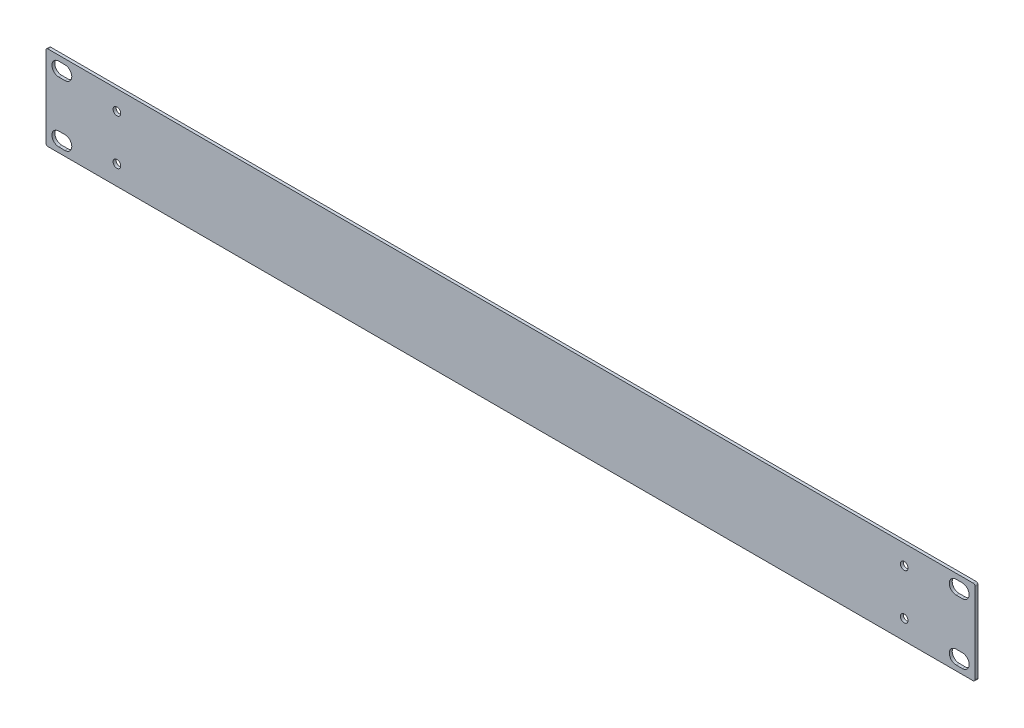
ISO-10303-21;
HEADER;
FILE_DESCRIPTION(('STEP AP214'),'2;1');
FILE_NAME('part.step','',(''),(''),'','','');
FILE_SCHEMA(('AUTOMOTIVE_DESIGN { 1 0 10303 214 1 1 1 1 }'));
ENDSEC;
DATA;
#1=APPLICATION_CONTEXT('core data for automotive mechanical design processes');
#2=APPLICATION_PROTOCOL_DEFINITION('international standard','automotive_design',2000,#1);
#3=PRODUCT_CONTEXT('',#1,'mechanical');
#4=PRODUCT('Part','Part','',(#3));
#5=PRODUCT_RELATED_PRODUCT_CATEGORY('part','',(#4));
#6=PRODUCT_DEFINITION_FORMATION('','',#4);
#7=PRODUCT_DEFINITION_CONTEXT('part definition',#1,'design');
#8=PRODUCT_DEFINITION('design','',#6,#7);
#9=PRODUCT_DEFINITION_SHAPE('','',#8);
#10=(LENGTH_UNIT() NAMED_UNIT(*) SI_UNIT(.MILLI.,.METRE.));
#11=(NAMED_UNIT(*) PLANE_ANGLE_UNIT() SI_UNIT($,.RADIAN.));
#12=(NAMED_UNIT(*) SI_UNIT($,.STERADIAN.) SOLID_ANGLE_UNIT());
#13=UNCERTAINTY_MEASURE_WITH_UNIT(LENGTH_MEASURE(1.E-05),#10,'distance_accuracy_value','');
#14=(GEOMETRIC_REPRESENTATION_CONTEXT(3) GLOBAL_UNCERTAINTY_ASSIGNED_CONTEXT((#13)) GLOBAL_UNIT_ASSIGNED_CONTEXT((#10,
#11,#12)) REPRESENTATION_CONTEXT('',''));
#15=CARTESIAN_POINT('',(0.,0.,0.));
#16=DIRECTION('',(0.,0.,1.));
#17=DIRECTION('',(1.,0.,0.));
#18=AXIS2_PLACEMENT_3D('',#15,#16,#17);
#19=CARTESIAN_POINT('',(-240.284,1.01599999999993,-1.524));
#20=DIRECTION('',(0.,0.,1.));
#21=DIRECTION('',(1.,0.,0.));
#22=AXIS2_PLACEMENT_3D('',#19,#20,#21);
#23=CYLINDRICAL_SURFACE('',#22,1.01599999999998);
#24=CARTESIAN_POINT('',(-240.284,1.01599999999993,0.));
#25=DIRECTION('',(0.,0.,1.));
#26=DIRECTION('',(-1.,0.,0.));
#27=AXIS2_PLACEMENT_3D('',#24,#25,#26);
#28=CIRCLE('',#27,1.01599999999998);
#29=CARTESIAN_POINT('',(-241.3,1.01599999999993,0.));
#30=VERTEX_POINT('',#29);
#31=CARTESIAN_POINT('',(-240.284,0.,0.));
#32=VERTEX_POINT('',#31);
#33=EDGE_CURVE('E331',#30,#32,#28,.T.);
#34=ORIENTED_EDGE('',*,*,#33,.F.);
#35=DIRECTION('',(0.,0.,1.));
#36=VECTOR('',#35,1.);
#37=CARTESIAN_POINT('',(-241.3,1.01599999999993,-1.524));
#38=LINE('',#37,#36);
#39=CARTESIAN_POINT('',(-241.3,1.01599999999993,-1.524));
#40=VERTEX_POINT('',#39);
#41=EDGE_CURVE('E11',#40,#30,#38,.T.);
#42=ORIENTED_EDGE('',*,*,#41,.F.);
#43=CARTESIAN_POINT('',(-240.284,1.01599999999993,-1.524));
#44=DIRECTION('',(0.,0.,1.));
#45=DIRECTION('',(-1.,0.,0.));
#46=AXIS2_PLACEMENT_3D('',#43,#44,#45);
#47=CIRCLE('',#46,1.01599999999998);
#48=CARTESIAN_POINT('',(-240.284,0.,-1.524));
#49=VERTEX_POINT('',#48);
#50=EDGE_CURVE('E338',#40,#49,#47,.T.);
#51=ORIENTED_EDGE('',*,*,#50,.T.);
#52=DIRECTION('',(0.,0.,1.));
#53=VECTOR('',#52,1.);
#54=CARTESIAN_POINT('',(-240.284,0.,-1.524));
#55=LINE('',#54,#53);
#56=EDGE_CURVE('E41',#49,#32,#55,.T.);
#57=ORIENTED_EDGE('',*,*,#56,.T.);
#58=EDGE_LOOP('',(#34,#42,#51,#57));
#59=FACE_BOUND('',#58,.T.);
#60=ADVANCED_FACE('F38',(#59),#23,.T.);
#61=CARTESIAN_POINT('',(-241.3,42.9259999999999,-1.524));
#62=DIRECTION('',(-1.,0.,0.));
#63=DIRECTION('',(0.,0.,1.));
#64=AXIS2_PLACEMENT_3D('',#61,#62,#63);
#65=PLANE('',#64);
#66=DIRECTION('',(0.,-1.,0.));
#67=VECTOR('',#66,1.);
#68=CARTESIAN_POINT('',(-241.3,42.9259999999999,0.));
#69=LINE('',#68,#67);
#70=CARTESIAN_POINT('',(-241.3,42.9259999999999,0.));
#71=VERTEX_POINT('',#70);
#72=EDGE_CURVE('E342',#71,#30,#69,.T.);
#73=ORIENTED_EDGE('',*,*,#72,.F.);
#74=DIRECTION('',(0.,0.,1.));
#75=VECTOR('',#74,1.);
#76=CARTESIAN_POINT('',(-241.3,42.9259999999999,-1.524));
#77=LINE('',#76,#75);
#78=CARTESIAN_POINT('',(-241.3,42.9259999999999,-1.524));
#79=VERTEX_POINT('',#78);
#80=EDGE_CURVE('E46',#79,#71,#77,.T.);
#81=ORIENTED_EDGE('',*,*,#80,.F.);
#82=DIRECTION('',(0.,-1.,0.));
#83=VECTOR('',#82,1.);
#84=CARTESIAN_POINT('',(-241.3,42.9259999999999,-1.524));
#85=LINE('',#84,#83);
#86=EDGE_CURVE('E360',#79,#40,#85,.T.);
#87=ORIENTED_EDGE('',*,*,#86,.T.);
#88=ORIENTED_EDGE('',*,*,#41,.T.);
#89=EDGE_LOOP('',(#73,#81,#87,#88));
#90=FACE_BOUND('',#89,.T.);
#91=ADVANCED_FACE('F407',(#90),#65,.T.);
#92=CARTESIAN_POINT('',(-240.284,42.9259999999999,-1.524));
#93=DIRECTION('',(0.,0.,1.));
#94=DIRECTION('',(1.,0.,0.));
#95=AXIS2_PLACEMENT_3D('',#92,#93,#94);
#96=CYLINDRICAL_SURFACE('',#95,1.01599999999999);
#97=CARTESIAN_POINT('',(-240.284,42.9259999999999,0.));
#98=DIRECTION('',(0.,0.,1.));
#99=DIRECTION('',(1.,0.,0.));
#100=AXIS2_PLACEMENT_3D('',#97,#98,#99);
#101=CIRCLE('',#100,1.01599999999999);
#102=CARTESIAN_POINT('',(-240.284,43.9419999999999,0.));
#103=VERTEX_POINT('',#102);
#104=EDGE_CURVE('E380',#103,#71,#101,.T.);
#105=ORIENTED_EDGE('',*,*,#104,.F.);
#106=DIRECTION('',(0.,0.,1.));
#107=VECTOR('',#106,1.);
#108=CARTESIAN_POINT('',(-240.284,43.9419999999999,-1.524));
#109=LINE('',#108,#107);
#110=CARTESIAN_POINT('',(-240.284,43.9419999999999,-1.524));
#111=VERTEX_POINT('',#110);
#112=EDGE_CURVE('E386',#111,#103,#109,.T.);
#113=ORIENTED_EDGE('',*,*,#112,.F.);
#114=CARTESIAN_POINT('',(-240.284,42.9259999999999,-1.524));
#115=DIRECTION('',(0.,0.,1.));
#116=DIRECTION('',(1.,0.,0.));
#117=AXIS2_PLACEMENT_3D('',#114,#115,#116);
#118=CIRCLE('',#117,1.01599999999999);
#119=EDGE_CURVE('E357',#111,#79,#118,.T.);
#120=ORIENTED_EDGE('',*,*,#119,.T.);
#121=ORIENTED_EDGE('',*,*,#80,.T.);
#122=EDGE_LOOP('',(#105,#113,#120,#121));
#123=FACE_BOUND('',#122,.T.);
#124=ADVANCED_FACE('F427',(#123),#96,.T.);
#125=CARTESIAN_POINT('',(240.284,43.942,-1.524));
#126=DIRECTION('',(0.,1.,0.));
#127=DIRECTION('',(-1.,0.,0.));
#128=AXIS2_PLACEMENT_3D('',#125,#126,#127);
#129=PLANE('',#128);
#130=DIRECTION('',(-1.,0.,0.));
#131=VECTOR('',#130,1.);
#132=CARTESIAN_POINT('',(240.284,43.942,0.));
#133=LINE('',#132,#131);
#134=CARTESIAN_POINT('',(240.284,43.9419999999999,0.));
#135=VERTEX_POINT('',#134);
#136=EDGE_CURVE('E377',#135,#103,#133,.T.);
#137=ORIENTED_EDGE('',*,*,#136,.F.);
#138=DIRECTION('',(0.,0.,1.));
#139=VECTOR('',#138,1.);
#140=CARTESIAN_POINT('',(240.284,43.9419999999999,-1.524));
#141=LINE('',#140,#139);
#142=CARTESIAN_POINT('',(240.284,43.9419999999999,-1.524));
#143=VERTEX_POINT('',#142);
#144=EDGE_CURVE('E388',#143,#135,#141,.T.);
#145=ORIENTED_EDGE('',*,*,#144,.F.);
#146=DIRECTION('',(-1.,0.,0.));
#147=VECTOR('',#146,1.);
#148=CARTESIAN_POINT('',(240.284,43.942,-1.524));
#149=LINE('',#148,#147);
#150=EDGE_CURVE('E354',#143,#111,#149,.T.);
#151=ORIENTED_EDGE('',*,*,#150,.T.);
#152=ORIENTED_EDGE('',*,*,#112,.T.);
#153=EDGE_LOOP('',(#137,#145,#151,#152));
#154=FACE_BOUND('',#153,.T.);
#155=ADVANCED_FACE('F425',(#154),#129,.T.);
#156=CARTESIAN_POINT('',(240.284,42.9259999999999,-1.524));
#157=DIRECTION('',(0.,0.,1.));
#158=DIRECTION('',(1.,0.,0.));
#159=AXIS2_PLACEMENT_3D('',#156,#157,#158);
#160=CYLINDRICAL_SURFACE('',#159,1.01599999999999);
#161=CARTESIAN_POINT('',(240.284,42.9259999999999,0.));
#162=DIRECTION('',(0.,0.,1.));
#163=DIRECTION('',(-1.,0.,0.));
#164=AXIS2_PLACEMENT_3D('',#161,#162,#163);
#165=CIRCLE('',#164,1.01599999999999);
#166=CARTESIAN_POINT('',(241.3,42.926,0.));
#167=VERTEX_POINT('',#166);
#168=EDGE_CURVE('E374',#167,#135,#165,.T.);
#169=ORIENTED_EDGE('',*,*,#168,.F.);
#170=DIRECTION('',(0.,0.,1.));
#171=VECTOR('',#170,1.);
#172=CARTESIAN_POINT('',(241.3,42.926,-1.524));
#173=LINE('',#172,#171);
#174=CARTESIAN_POINT('',(241.3,42.926,-1.524));
#175=VERTEX_POINT('',#174);
#176=EDGE_CURVE('E390',#175,#167,#173,.T.);
#177=ORIENTED_EDGE('',*,*,#176,.F.);
#178=CARTESIAN_POINT('',(240.284,42.9259999999999,-1.524));
#179=DIRECTION('',(0.,0.,1.));
#180=DIRECTION('',(-1.,0.,0.));
#181=AXIS2_PLACEMENT_3D('',#178,#179,#180);
#182=CIRCLE('',#181,1.01599999999999);
#183=EDGE_CURVE('E351',#175,#143,#182,.T.);
#184=ORIENTED_EDGE('',*,*,#183,.T.);
#185=ORIENTED_EDGE('',*,*,#144,.T.);
#186=EDGE_LOOP('',(#169,#177,#184,#185));
#187=FACE_BOUND('',#186,.T.);
#188=ADVANCED_FACE('F421',(#187),#160,.T.);
#189=CARTESIAN_POINT('',(241.3,42.926,-1.524));
#190=DIRECTION('',(1.,0.,0.));
#191=DIRECTION('',(0.,0.,-1.));
#192=AXIS2_PLACEMENT_3D('',#189,#190,#191);
#193=PLANE('',#192);
#194=DIRECTION('',(0.,1.,0.));
#195=VECTOR('',#194,1.);
#196=CARTESIAN_POINT('',(241.3,42.926,0.));
#197=LINE('',#196,#195);
#198=CARTESIAN_POINT('',(241.3,1.01599999999999,0.));
#199=VERTEX_POINT('',#198);
#200=EDGE_CURVE('E371',#199,#167,#197,.T.);
#201=ORIENTED_EDGE('',*,*,#200,.F.);
#202=DIRECTION('',(0.,0.,1.));
#203=VECTOR('',#202,1.);
#204=CARTESIAN_POINT('',(241.3,1.01599999999999,-1.524));
#205=LINE('',#204,#203);
#206=CARTESIAN_POINT('',(241.3,1.01599999999999,-1.524));
#207=VERTEX_POINT('',#206);
#208=EDGE_CURVE('E392',#207,#199,#205,.T.);
#209=ORIENTED_EDGE('',*,*,#208,.F.);
#210=DIRECTION('',(0.,1.,0.));
#211=VECTOR('',#210,1.);
#212=CARTESIAN_POINT('',(241.3,42.926,-1.524));
#213=LINE('',#212,#211);
#214=EDGE_CURVE('E348',#207,#175,#213,.T.);
#215=ORIENTED_EDGE('',*,*,#214,.T.);
#216=ORIENTED_EDGE('',*,*,#176,.T.);
#217=EDGE_LOOP('',(#201,#209,#215,#216));
#218=FACE_BOUND('',#217,.T.);
#219=ADVANCED_FACE('F419',(#218),#193,.T.);
#220=CARTESIAN_POINT('',(240.284,1.01599999999999,-1.524));
#221=DIRECTION('',(0.,0.,1.));
#222=DIRECTION('',(1.,0.,0.));
#223=AXIS2_PLACEMENT_3D('',#220,#221,#222);
#224=CYLINDRICAL_SURFACE('',#223,1.01599999999998);
#225=CARTESIAN_POINT('',(240.284,1.01599999999999,0.));
#226=DIRECTION('',(0.,0.,1.));
#227=DIRECTION('',(-1.,0.,0.));
#228=AXIS2_PLACEMENT_3D('',#225,#226,#227);
#229=CIRCLE('',#228,1.01599999999998);
#230=CARTESIAN_POINT('',(240.284,0.,0.));
#231=VERTEX_POINT('',#230);
#232=EDGE_CURVE('E368',#231,#199,#229,.T.);
#233=ORIENTED_EDGE('',*,*,#232,.F.);
#234=DIRECTION('',(0.,0.,1.));
#235=VECTOR('',#234,1.);
#236=CARTESIAN_POINT('',(240.284,0.,-1.524));
#237=LINE('',#236,#235);
#238=CARTESIAN_POINT('',(240.284,0.,-1.524));
#239=VERTEX_POINT('',#238);
#240=EDGE_CURVE('E393',#239,#231,#237,.T.);
#241=ORIENTED_EDGE('',*,*,#240,.F.);
#242=CARTESIAN_POINT('',(240.284,1.01599999999999,-1.524));
#243=DIRECTION('',(0.,0.,1.));
#244=DIRECTION('',(-1.,0.,0.));
#245=AXIS2_PLACEMENT_3D('',#242,#243,#244);
#246=CIRCLE('',#245,1.01599999999998);
#247=EDGE_CURVE('E345',#239,#207,#246,.T.);
#248=ORIENTED_EDGE('',*,*,#247,.T.);
#249=ORIENTED_EDGE('',*,*,#208,.T.);
#250=EDGE_LOOP('',(#233,#241,#248,#249));
#251=FACE_BOUND('',#250,.T.);
#252=ADVANCED_FACE('F415',(#251),#224,.T.);
#253=CARTESIAN_POINT('',(240.284,0.,-1.524));
#254=DIRECTION('',(0.,-1.,0.));
#255=DIRECTION('',(1.,0.,0.));
#256=AXIS2_PLACEMENT_3D('',#253,#254,#255);
#257=PLANE('',#256);
#258=DIRECTION('',(1.,0.,0.));
#259=VECTOR('',#258,1.);
#260=CARTESIAN_POINT('',(240.284,0.,0.));
#261=LINE('',#260,#259);
#262=EDGE_CURVE('E365',#32,#231,#261,.T.);
#263=ORIENTED_EDGE('',*,*,#262,.F.);
#264=ORIENTED_EDGE('',*,*,#56,.F.);
#265=DIRECTION('',(1.,0.,0.));
#266=VECTOR('',#265,1.);
#267=CARTESIAN_POINT('',(240.284,0.,-1.524));
#268=LINE('',#267,#266);
#269=EDGE_CURVE('E341',#49,#239,#268,.T.);
#270=ORIENTED_EDGE('',*,*,#269,.T.);
#271=ORIENTED_EDGE('',*,*,#240,.T.);
#272=EDGE_LOOP('',(#263,#264,#270,#271));
#273=FACE_BOUND('',#272,.T.);
#274=ADVANCED_FACE('F401',(#273),#257,.T.);
#275=CARTESIAN_POINT('',(-240.284,1.01599999999993,-1.524));
#276=DIRECTION('',(0.,0.,-1.));
#277=DIRECTION('',(-1.,0.,0.));
#278=AXIS2_PLACEMENT_3D('',#275,#276,#277);
#279=PLANE('',#278);
#280=CARTESIAN_POINT('',(-204.47,10.1599999999999,-1.524));
#281=DIRECTION('',(0.,0.,1.));
#282=DIRECTION('',(-1.,0.,0.));
#283=AXIS2_PLACEMENT_3D('',#280,#281,#282);
#284=CIRCLE('',#283,2.);
#285=CARTESIAN_POINT('',(-206.47,10.1599999999999,-1.524));
#286=VERTEX_POINT('',#285);
#287=EDGE_CURVE('E765',#286,#286,#284,.T.);
#288=ORIENTED_EDGE('',*,*,#287,.T.);
#289=EDGE_LOOP('',(#288));
#290=FACE_BOUND('',#289,.T.);
#291=CARTESIAN_POINT('',(204.47,10.1599999999994,-1.524));
#292=DIRECTION('',(0.,0.,1.));
#293=DIRECTION('',(1.,0.,0.));
#294=AXIS2_PLACEMENT_3D('',#291,#292,#293);
#295=CIRCLE('',#294,2.);
#296=CARTESIAN_POINT('',(206.47,10.1599999999994,-1.524));
#297=VERTEX_POINT('',#296);
#298=EDGE_CURVE('E769',#297,#297,#295,.T.);
#299=ORIENTED_EDGE('',*,*,#298,.T.);
#300=EDGE_LOOP('',(#299));
#301=FACE_BOUND('',#300,.T.);
#302=CARTESIAN_POINT('',(204.47,33.7819999999994,-1.524));
#303=DIRECTION('',(0.,0.,1.));
#304=DIRECTION('',(-1.,0.,0.));
#305=AXIS2_PLACEMENT_3D('',#302,#303,#304);
#306=CIRCLE('',#305,2.);
#307=CARTESIAN_POINT('',(202.47,33.7819999999994,-1.524));
#308=VERTEX_POINT('',#307);
#309=EDGE_CURVE('E778',#308,#308,#306,.T.);
#310=ORIENTED_EDGE('',*,*,#309,.T.);
#311=EDGE_LOOP('',(#310));
#312=FACE_BOUND('',#311,.T.);
#313=CARTESIAN_POINT('',(-204.47,33.7819999999999,-1.524));
#314=DIRECTION('',(0.,0.,1.));
#315=DIRECTION('',(1.,0.,0.));
#316=AXIS2_PLACEMENT_3D('',#313,#314,#315);
#317=CIRCLE('',#316,2.);
#318=CARTESIAN_POINT('',(-202.47,33.7819999999999,-1.524));
#319=VERTEX_POINT('',#318);
#320=EDGE_CURVE('E291',#319,#319,#317,.T.);
#321=ORIENTED_EDGE('',*,*,#320,.T.);
#322=EDGE_LOOP('',(#321));
#323=FACE_BOUND('',#322,.T.);
#324=CARTESIAN_POINT('',(-234.6706,37.6935999999998,-1.524));
#325=DIRECTION('',(0.,0.,1.));
#326=DIRECTION('',(-1.,0.,0.));
#327=AXIS2_PLACEMENT_3D('',#324,#325,#326);
#328=CIRCLE('',#327,3.556);
#329=CARTESIAN_POINT('',(-234.6706,41.2495999999998,-1.524));
#330=VERTEX_POINT('',#329);
#331=CARTESIAN_POINT('',(-234.6706,34.1375999999998,-1.524));
#332=VERTEX_POINT('',#331);
#333=EDGE_CURVE('E203',#330,#332,#328,.T.);
#334=ORIENTED_EDGE('',*,*,#333,.T.);
#335=DIRECTION('',(1.,0.,0.));
#336=VECTOR('',#335,1.);
#337=CARTESIAN_POINT('',(-234.6706,34.1375999999998,-1.524));
#338=LINE('',#337,#336);
#339=CARTESIAN_POINT('',(-231.4702,34.1375999999998,-1.524));
#340=VERTEX_POINT('',#339);
#341=EDGE_CURVE('E214',#332,#340,#338,.T.);
#342=ORIENTED_EDGE('',*,*,#341,.T.);
#343=CARTESIAN_POINT('',(-231.4702,37.6935999999998,-1.524));
#344=DIRECTION('',(0.,0.,1.));
#345=DIRECTION('',(-1.,0.,0.));
#346=AXIS2_PLACEMENT_3D('',#343,#344,#345);
#347=CIRCLE('',#346,3.556);
#348=CARTESIAN_POINT('',(-231.4702,41.2495999999998,-1.524));
#349=VERTEX_POINT('',#348);
#350=EDGE_CURVE('E54',#340,#349,#347,.T.);
#351=ORIENTED_EDGE('',*,*,#350,.T.);
#352=DIRECTION('',(-1.,0.,0.));
#353=VECTOR('',#352,1.);
#354=CARTESIAN_POINT('',(-234.6706,41.2495999999998,-1.524));
#355=LINE('',#354,#353);
#356=EDGE_CURVE('E211',#349,#330,#355,.T.);
#357=ORIENTED_EDGE('',*,*,#356,.T.);
#358=EDGE_LOOP('',(#334,#342,#351,#357));
#359=FACE_BOUND('',#358,.T.);
#360=CARTESIAN_POINT('',(234.6706,6.24839999999933,-1.524));
#361=DIRECTION('',(0.,0.,1.));
#362=DIRECTION('',(-1.,0.,0.));
#363=AXIS2_PLACEMENT_3D('',#360,#361,#362);
#364=CIRCLE('',#363,3.556);
#365=CARTESIAN_POINT('',(234.6706,2.69239999999933,-1.524));
#366=VERTEX_POINT('',#365);
#367=CARTESIAN_POINT('',(234.6706,9.80439999999933,-1.524));
#368=VERTEX_POINT('',#367);
#369=EDGE_CURVE('E244',#366,#368,#364,.T.);
#370=ORIENTED_EDGE('',*,*,#369,.T.);
#371=DIRECTION('',(-1.,0.,0.));
#372=VECTOR('',#371,1.);
#373=CARTESIAN_POINT('',(234.6706,9.80439999999933,-1.524));
#374=LINE('',#373,#372);
#375=CARTESIAN_POINT('',(231.4702,9.80439999999934,-1.524));
#376=VERTEX_POINT('',#375);
#377=EDGE_CURVE('E247',#368,#376,#374,.T.);
#378=ORIENTED_EDGE('',*,*,#377,.T.);
#379=CARTESIAN_POINT('',(231.4702,6.24839999999934,-1.524));
#380=DIRECTION('',(0.,0.,1.));
#381=DIRECTION('',(-1.,0.,0.));
#382=AXIS2_PLACEMENT_3D('',#379,#380,#381);
#383=CIRCLE('',#382,3.556);
#384=CARTESIAN_POINT('',(231.4702,2.69239999999934,-1.524));
#385=VERTEX_POINT('',#384);
#386=EDGE_CURVE('E62',#376,#385,#383,.T.);
#387=ORIENTED_EDGE('',*,*,#386,.T.);
#388=DIRECTION('',(1.,0.,0.));
#389=VECTOR('',#388,1.);
#390=CARTESIAN_POINT('',(234.6706,2.69239999999933,-1.524));
#391=LINE('',#390,#389);
#392=EDGE_CURVE('E252',#385,#366,#391,.T.);
#393=ORIENTED_EDGE('',*,*,#392,.T.);
#394=EDGE_LOOP('',(#370,#378,#387,#393));
#395=FACE_BOUND('',#394,.T.);
#396=CARTESIAN_POINT('',(234.6706,37.6935999999992,-1.524));
#397=DIRECTION('',(0.,0.,1.));
#398=DIRECTION('',(1.,0.,0.));
#399=AXIS2_PLACEMENT_3D('',#396,#397,#398);
#400=CIRCLE('',#399,3.556);
#401=CARTESIAN_POINT('',(234.6706,34.1375999999992,-1.524));
#402=VERTEX_POINT('',#401);
#403=CARTESIAN_POINT('',(234.6706,41.2495999999992,-1.524));
#404=VERTEX_POINT('',#403);
#405=EDGE_CURVE('E274',#402,#404,#400,.T.);
#406=ORIENTED_EDGE('',*,*,#405,.T.);
#407=DIRECTION('',(-1.,0.,0.));
#408=VECTOR('',#407,1.);
#409=CARTESIAN_POINT('',(234.6706,41.2495999999992,-1.524));
#410=LINE('',#409,#408);
#411=CARTESIAN_POINT('',(231.4702,41.2495999999992,-1.524));
#412=VERTEX_POINT('',#411);
#413=EDGE_CURVE('E277',#404,#412,#410,.T.);
#414=ORIENTED_EDGE('',*,*,#413,.T.);
#415=CARTESIAN_POINT('',(231.4702,37.6935999999992,-1.524));
#416=DIRECTION('',(0.,0.,1.));
#417=DIRECTION('',(1.,0.,0.));
#418=AXIS2_PLACEMENT_3D('',#415,#416,#417);
#419=CIRCLE('',#418,3.556);
#420=CARTESIAN_POINT('',(231.4702,34.1375999999992,-1.524));
#421=VERTEX_POINT('',#420);
#422=EDGE_CURVE('E281',#412,#421,#419,.T.);
#423=ORIENTED_EDGE('',*,*,#422,.T.);
#424=DIRECTION('',(1.,0.,0.));
#425=VECTOR('',#424,1.);
#426=CARTESIAN_POINT('',(234.6706,34.1375999999992,-1.524));
#427=LINE('',#426,#425);
#428=EDGE_CURVE('E284',#421,#402,#427,.T.);
#429=ORIENTED_EDGE('',*,*,#428,.T.);
#430=EDGE_LOOP('',(#406,#414,#423,#429));
#431=FACE_BOUND('',#430,.T.);
#432=CARTESIAN_POINT('',(-234.6706,6.24839999999992,-1.524));
#433=DIRECTION('',(0.,0.,1.));
#434=DIRECTION('',(1.,0.,0.));
#435=AXIS2_PLACEMENT_3D('',#432,#433,#434);
#436=CIRCLE('',#435,3.556);
#437=CARTESIAN_POINT('',(-234.6706,9.80439999999992,-1.524));
#438=VERTEX_POINT('',#437);
#439=CARTESIAN_POINT('',(-234.6706,2.69239999999992,-1.524));
#440=VERTEX_POINT('',#439);
#441=EDGE_CURVE('E306',#438,#440,#436,.T.);
#442=ORIENTED_EDGE('',*,*,#441,.T.);
#443=DIRECTION('',(1.,0.,0.));
#444=VECTOR('',#443,1.);
#445=CARTESIAN_POINT('',(-234.6706,2.69239999999992,-1.524));
#446=LINE('',#445,#444);
#447=CARTESIAN_POINT('',(-231.4702,2.69239999999993,-1.524));
#448=VERTEX_POINT('',#447);
#449=EDGE_CURVE('E309',#440,#448,#446,.T.);
#450=ORIENTED_EDGE('',*,*,#449,.T.);
#451=CARTESIAN_POINT('',(-231.4702,6.24839999999992,-1.524));
#452=DIRECTION('',(0.,0.,1.));
#453=DIRECTION('',(1.,0.,0.));
#454=AXIS2_PLACEMENT_3D('',#451,#452,#453);
#455=CIRCLE('',#454,3.556);
#456=CARTESIAN_POINT('',(-231.4702,9.80439999999992,-1.524));
#457=VERTEX_POINT('',#456);
#458=EDGE_CURVE('E313',#448,#457,#455,.T.);
#459=ORIENTED_EDGE('',*,*,#458,.T.);
#460=DIRECTION('',(-1.,0.,0.));
#461=VECTOR('',#460,1.);
#462=CARTESIAN_POINT('',(-234.6706,9.80439999999992,-1.524));
#463=LINE('',#462,#461);
#464=EDGE_CURVE('E316',#457,#438,#463,.T.);
#465=ORIENTED_EDGE('',*,*,#464,.T.);
#466=EDGE_LOOP('',(#442,#450,#459,#465));
#467=FACE_BOUND('',#466,.T.);
#468=ORIENTED_EDGE('',*,*,#50,.F.);
#469=ORIENTED_EDGE('',*,*,#86,.F.);
#470=ORIENTED_EDGE('',*,*,#119,.F.);
#471=ORIENTED_EDGE('',*,*,#150,.F.);
#472=ORIENTED_EDGE('',*,*,#183,.F.);
#473=ORIENTED_EDGE('',*,*,#214,.F.);
#474=ORIENTED_EDGE('',*,*,#247,.F.);
#475=ORIENTED_EDGE('',*,*,#269,.F.);
#476=EDGE_LOOP('',(#468,#469,#470,#471,#472,#473,#474,#475));
#477=FACE_BOUND('',#476,.T.);
#478=ADVANCED_FACE('F218',(#290,#301,#312,#323,#359,#395,#431,#467,#477),#279,.T.);
#479=CARTESIAN_POINT('',(-240.284,1.01599999999993,0.));
#480=DIRECTION('',(0.,0.,-1.));
#481=DIRECTION('',(-1.,0.,0.));
#482=AXIS2_PLACEMENT_3D('',#479,#480,#481);
#483=PLANE('',#482);
#484=CARTESIAN_POINT('',(-204.47,10.1599999999999,0.));
#485=DIRECTION('',(0.,0.,1.));
#486=DIRECTION('',(-1.,0.,0.));
#487=AXIS2_PLACEMENT_3D('',#484,#485,#486);
#488=CIRCLE('',#487,2.);
#489=CARTESIAN_POINT('',(-206.47,10.1599999999999,0.));
#490=VERTEX_POINT('',#489);
#491=EDGE_CURVE('E768',#490,#490,#488,.T.);
#492=ORIENTED_EDGE('',*,*,#491,.F.);
#493=EDGE_LOOP('',(#492));
#494=FACE_BOUND('',#493,.T.);
#495=CARTESIAN_POINT('',(204.47,10.1599999999994,0.));
#496=DIRECTION('',(0.,0.,1.));
#497=DIRECTION('',(1.,0.,0.));
#498=AXIS2_PLACEMENT_3D('',#495,#496,#497);
#499=CIRCLE('',#498,2.);
#500=CARTESIAN_POINT('',(206.47,10.1599999999994,0.));
#501=VERTEX_POINT('',#500);
#502=EDGE_CURVE('E773',#501,#501,#499,.T.);
#503=ORIENTED_EDGE('',*,*,#502,.F.);
#504=EDGE_LOOP('',(#503));
#505=FACE_BOUND('',#504,.T.);
#506=CARTESIAN_POINT('',(204.47,33.7819999999994,0.));
#507=DIRECTION('',(0.,0.,1.));
#508=DIRECTION('',(-1.,0.,0.));
#509=AXIS2_PLACEMENT_3D('',#506,#507,#508);
#510=CIRCLE('',#509,2.);
#511=CARTESIAN_POINT('',(202.47,33.7819999999994,0.));
#512=VERTEX_POINT('',#511);
#513=EDGE_CURVE('E781',#512,#512,#510,.T.);
#514=ORIENTED_EDGE('',*,*,#513,.F.);
#515=EDGE_LOOP('',(#514));
#516=FACE_BOUND('',#515,.T.);
#517=CARTESIAN_POINT('',(-204.47,33.7819999999999,0.));
#518=DIRECTION('',(0.,0.,1.));
#519=DIRECTION('',(1.,0.,0.));
#520=AXIS2_PLACEMENT_3D('',#517,#518,#519);
#521=CIRCLE('',#520,2.);
#522=CARTESIAN_POINT('',(-202.47,33.7819999999999,0.));
#523=VERTEX_POINT('',#522);
#524=EDGE_CURVE('E227',#523,#523,#521,.T.);
#525=ORIENTED_EDGE('',*,*,#524,.F.);
#526=EDGE_LOOP('',(#525));
#527=FACE_BOUND('',#526,.T.);
#528=DIRECTION('',(1.,0.,0.));
#529=VECTOR('',#528,1.);
#530=CARTESIAN_POINT('',(-234.6706,34.1375999999998,0.));
#531=LINE('',#530,#529);
#532=CARTESIAN_POINT('',(-234.6706,34.1375999999998,0.));
#533=VERTEX_POINT('',#532);
#534=CARTESIAN_POINT('',(-231.4702,34.1375999999998,0.));
#535=VERTEX_POINT('',#534);
#536=EDGE_CURVE('E233',#533,#535,#531,.T.);
#537=ORIENTED_EDGE('',*,*,#536,.F.);
#538=CARTESIAN_POINT('',(-234.6706,37.6935999999998,0.));
#539=DIRECTION('',(0.,0.,1.));
#540=DIRECTION('',(-1.,0.,0.));
#541=AXIS2_PLACEMENT_3D('',#538,#539,#540);
#542=CIRCLE('',#541,3.556);
#543=CARTESIAN_POINT('',(-234.6706,41.2495999999998,0.));
#544=VERTEX_POINT('',#543);
#545=EDGE_CURVE('E206',#544,#533,#542,.T.);
#546=ORIENTED_EDGE('',*,*,#545,.F.);
#547=DIRECTION('',(-1.,0.,0.));
#548=VECTOR('',#547,1.);
#549=CARTESIAN_POINT('',(-234.6706,41.2495999999998,0.));
#550=LINE('',#549,#548);
#551=CARTESIAN_POINT('',(-231.4702,41.2495999999998,0.));
#552=VERTEX_POINT('',#551);
#553=EDGE_CURVE('E221',#552,#544,#550,.T.);
#554=ORIENTED_EDGE('',*,*,#553,.F.);
#555=CARTESIAN_POINT('',(-231.4702,37.6935999999998,0.));
#556=DIRECTION('',(0.,0.,1.));
#557=DIRECTION('',(-1.,0.,0.));
#558=AXIS2_PLACEMENT_3D('',#555,#556,#557);
#559=CIRCLE('',#558,3.556);
#560=EDGE_CURVE('E224',#535,#552,#559,.T.);
#561=ORIENTED_EDGE('',*,*,#560,.F.);
#562=EDGE_LOOP('',(#537,#546,#554,#561));
#563=FACE_BOUND('',#562,.T.);
#564=DIRECTION('',(-1.,0.,0.));
#565=VECTOR('',#564,1.);
#566=CARTESIAN_POINT('',(234.6706,9.80439999999933,0.));
#567=LINE('',#566,#565);
#568=CARTESIAN_POINT('',(234.6706,9.80439999999933,0.));
#569=VERTEX_POINT('',#568);
#570=CARTESIAN_POINT('',(231.4702,9.80439999999934,0.));
#571=VERTEX_POINT('',#570);
#572=EDGE_CURVE('E258',#569,#571,#567,.T.);
#573=ORIENTED_EDGE('',*,*,#572,.F.);
#574=CARTESIAN_POINT('',(234.6706,6.24839999999933,0.));
#575=DIRECTION('',(0.,0.,1.));
#576=DIRECTION('',(-1.,0.,0.));
#577=AXIS2_PLACEMENT_3D('',#574,#575,#576);
#578=CIRCLE('',#577,3.556);
#579=CARTESIAN_POINT('',(234.6706,2.69239999999933,0.));
#580=VERTEX_POINT('',#579);
#581=EDGE_CURVE('E256',#580,#569,#578,.T.);
#582=ORIENTED_EDGE('',*,*,#581,.F.);
#583=DIRECTION('',(1.,0.,0.));
#584=VECTOR('',#583,1.);
#585=CARTESIAN_POINT('',(234.6706,2.69239999999933,0.));
#586=LINE('',#585,#584);
#587=CARTESIAN_POINT('',(231.4702,2.69239999999934,0.));
#588=VERTEX_POINT('',#587);
#589=EDGE_CURVE('E248',#588,#580,#586,.T.);
#590=ORIENTED_EDGE('',*,*,#589,.F.);
#591=CARTESIAN_POINT('',(231.4702,6.24839999999934,0.));
#592=DIRECTION('',(0.,0.,1.));
#593=DIRECTION('',(-1.,0.,0.));
#594=AXIS2_PLACEMENT_3D('',#591,#592,#593);
#595=CIRCLE('',#594,3.556);
#596=EDGE_CURVE('E262',#571,#588,#595,.T.);
#597=ORIENTED_EDGE('',*,*,#596,.F.);
#598=EDGE_LOOP('',(#573,#582,#590,#597));
#599=FACE_BOUND('',#598,.T.);
#600=DIRECTION('',(-1.,0.,0.));
#601=VECTOR('',#600,1.);
#602=CARTESIAN_POINT('',(234.6706,41.2495999999992,0.));
#603=LINE('',#602,#601);
#604=CARTESIAN_POINT('',(234.6706,41.2495999999992,0.));
#605=VERTEX_POINT('',#604);
#606=CARTESIAN_POINT('',(231.4702,41.2495999999992,0.));
#607=VERTEX_POINT('',#606);
#608=EDGE_CURVE('E290',#605,#607,#603,.T.);
#609=ORIENTED_EDGE('',*,*,#608,.F.);
#610=CARTESIAN_POINT('',(234.6706,37.6935999999992,0.));
#611=DIRECTION('',(0.,0.,1.));
#612=DIRECTION('',(1.,0.,0.));
#613=AXIS2_PLACEMENT_3D('',#610,#611,#612);
#614=CIRCLE('',#613,3.556);
#615=CARTESIAN_POINT('',(234.6706,34.1375999999992,0.));
#616=VERTEX_POINT('',#615);
#617=EDGE_CURVE('E288',#616,#605,#614,.T.);
#618=ORIENTED_EDGE('',*,*,#617,.F.);
#619=DIRECTION('',(1.,0.,0.));
#620=VECTOR('',#619,1.);
#621=CARTESIAN_POINT('',(234.6706,34.1375999999992,0.));
#622=LINE('',#621,#620);
#623=CARTESIAN_POINT('',(231.4702,34.1375999999992,0.));
#624=VERTEX_POINT('',#623);
#625=EDGE_CURVE('E278',#624,#616,#622,.T.);
#626=ORIENTED_EDGE('',*,*,#625,.F.);
#627=CARTESIAN_POINT('',(231.4702,37.6935999999992,0.));
#628=DIRECTION('',(0.,0.,1.));
#629=DIRECTION('',(1.,0.,0.));
#630=AXIS2_PLACEMENT_3D('',#627,#628,#629);
#631=CIRCLE('',#630,3.556);
#632=EDGE_CURVE('E294',#607,#624,#631,.T.);
#633=ORIENTED_EDGE('',*,*,#632,.F.);
#634=EDGE_LOOP('',(#609,#618,#626,#633));
#635=FACE_BOUND('',#634,.T.);
#636=DIRECTION('',(1.,0.,0.));
#637=VECTOR('',#636,1.);
#638=CARTESIAN_POINT('',(-234.6706,2.69239999999992,0.));
#639=LINE('',#638,#637);
#640=CARTESIAN_POINT('',(-234.6706,2.69239999999992,0.));
#641=VERTEX_POINT('',#640);
#642=CARTESIAN_POINT('',(-231.4702,2.69239999999992,0.));
#643=VERTEX_POINT('',#642);
#644=EDGE_CURVE('E321',#641,#643,#639,.T.);
#645=ORIENTED_EDGE('',*,*,#644,.F.);
#646=CARTESIAN_POINT('',(-234.6706,6.24839999999992,0.));
#647=DIRECTION('',(0.,0.,1.));
#648=DIRECTION('',(1.,0.,0.));
#649=AXIS2_PLACEMENT_3D('',#646,#647,#648);
#650=CIRCLE('',#649,3.556);
#651=CARTESIAN_POINT('',(-234.6706,9.80439999999992,0.));
#652=VERTEX_POINT('',#651);
#653=EDGE_CURVE('E240',#652,#641,#650,.T.);
#654=ORIENTED_EDGE('',*,*,#653,.F.);
#655=DIRECTION('',(-1.,0.,0.));
#656=VECTOR('',#655,1.);
#657=CARTESIAN_POINT('',(-234.6706,9.80439999999992,0.));
#658=LINE('',#657,#656);
#659=CARTESIAN_POINT('',(-231.4702,9.80439999999992,0.));
#660=VERTEX_POINT('',#659);
#661=EDGE_CURVE('E310',#660,#652,#658,.T.);
#662=ORIENTED_EDGE('',*,*,#661,.F.);
#663=CARTESIAN_POINT('',(-231.4702,6.24839999999992,0.));
#664=DIRECTION('',(0.,0.,1.));
#665=DIRECTION('',(1.,0.,0.));
#666=AXIS2_PLACEMENT_3D('',#663,#664,#665);
#667=CIRCLE('',#666,3.556);
#668=EDGE_CURVE('E324',#643,#660,#667,.T.);
#669=ORIENTED_EDGE('',*,*,#668,.F.);
#670=EDGE_LOOP('',(#645,#654,#662,#669));
#671=FACE_BOUND('',#670,.T.);
#672=ORIENTED_EDGE('',*,*,#33,.T.);
#673=ORIENTED_EDGE('',*,*,#262,.T.);
#674=ORIENTED_EDGE('',*,*,#232,.T.);
#675=ORIENTED_EDGE('',*,*,#200,.T.);
#676=ORIENTED_EDGE('',*,*,#168,.T.);
#677=ORIENTED_EDGE('',*,*,#136,.T.);
#678=ORIENTED_EDGE('',*,*,#104,.T.);
#679=ORIENTED_EDGE('',*,*,#72,.T.);
#680=EDGE_LOOP('',(#672,#673,#674,#675,#676,#677,#678,#679));
#681=FACE_BOUND('',#680,.T.);
#682=ADVANCED_FACE('F403',(#494,#505,#516,#527,#563,#599,#635,#671,#681),#483,.F.);
#683=CARTESIAN_POINT('',(-234.6706,6.24839999999992,-1.524));
#684=DIRECTION('',(0.,0.,1.));
#685=DIRECTION('',(1.,0.,0.));
#686=AXIS2_PLACEMENT_3D('',#683,#684,#685);
#687=CYLINDRICAL_SURFACE('',#686,3.556);
#688=ORIENTED_EDGE('',*,*,#653,.T.);
#689=DIRECTION('',(0.,0.,1.));
#690=VECTOR('',#689,1.);
#691=CARTESIAN_POINT('',(-234.6706,2.69239999999992,-1.524));
#692=LINE('',#691,#690);
#693=EDGE_CURVE('E319',#440,#641,#692,.T.);
#694=ORIENTED_EDGE('',*,*,#693,.F.);
#695=ORIENTED_EDGE('',*,*,#441,.F.);
#696=DIRECTION('',(0.,0.,1.));
#697=VECTOR('',#696,1.);
#698=CARTESIAN_POINT('',(-234.6706,9.80439999999992,-1.524));
#699=LINE('',#698,#697);
#700=EDGE_CURVE('E329',#438,#652,#699,.T.);
#701=ORIENTED_EDGE('',*,*,#700,.T.);
#702=EDGE_LOOP('',(#688,#694,#695,#701));
#703=FACE_BOUND('',#702,.T.);
#704=ADVANCED_FACE('F498',(#703),#687,.F.);
#705=CARTESIAN_POINT('',(-234.6706,9.80439999999992,-1.524));
#706=DIRECTION('',(0.,1.,0.));
#707=DIRECTION('',(0.,0.,1.));
#708=AXIS2_PLACEMENT_3D('',#705,#706,#707);
#709=PLANE('',#708);
#710=ORIENTED_EDGE('',*,*,#661,.T.);
#711=ORIENTED_EDGE('',*,*,#700,.F.);
#712=ORIENTED_EDGE('',*,*,#464,.F.);
#713=DIRECTION('',(0.,0.,1.));
#714=VECTOR('',#713,1.);
#715=CARTESIAN_POINT('',(-231.4702,9.80439999999992,-1.524));
#716=LINE('',#715,#714);
#717=EDGE_CURVE('E332',#457,#660,#716,.T.);
#718=ORIENTED_EDGE('',*,*,#717,.T.);
#719=EDGE_LOOP('',(#710,#711,#712,#718));
#720=FACE_BOUND('',#719,.T.);
#721=ADVANCED_FACE('F503',(#720),#709,.F.);
#722=CARTESIAN_POINT('',(-231.4702,6.24839999999992,-1.524));
#723=DIRECTION('',(0.,0.,1.));
#724=DIRECTION('',(1.,0.,0.));
#725=AXIS2_PLACEMENT_3D('',#722,#723,#724);
#726=CYLINDRICAL_SURFACE('',#725,3.556);
#727=ORIENTED_EDGE('',*,*,#668,.T.);
#728=ORIENTED_EDGE('',*,*,#717,.F.);
#729=ORIENTED_EDGE('',*,*,#458,.F.);
#730=DIRECTION('',(0.,0.,1.));
#731=VECTOR('',#730,1.);
#732=CARTESIAN_POINT('',(-231.4702,2.69239999999992,-1.524));
#733=LINE('',#732,#731);
#734=EDGE_CURVE('E334',#448,#643,#733,.T.);
#735=ORIENTED_EDGE('',*,*,#734,.T.);
#736=EDGE_LOOP('',(#727,#728,#729,#735));
#737=FACE_BOUND('',#736,.T.);
#738=ADVANCED_FACE('F516',(#737),#726,.F.);
#739=CARTESIAN_POINT('',(-234.6706,2.69239999999992,-1.524));
#740=DIRECTION('',(0.,-1.,0.));
#741=DIRECTION('',(1.,0.,0.));
#742=AXIS2_PLACEMENT_3D('',#739,#740,#741);
#743=PLANE('',#742);
#744=ORIENTED_EDGE('',*,*,#644,.T.);
#745=ORIENTED_EDGE('',*,*,#734,.F.);
#746=ORIENTED_EDGE('',*,*,#449,.F.);
#747=ORIENTED_EDGE('',*,*,#693,.T.);
#748=EDGE_LOOP('',(#744,#745,#746,#747));
#749=FACE_BOUND('',#748,.T.);
#750=ADVANCED_FACE('F527',(#749),#743,.F.);
#751=CARTESIAN_POINT('',(234.6706,37.6935999999992,-1.524));
#752=DIRECTION('',(0.,0.,1.));
#753=DIRECTION('',(1.,0.,0.));
#754=AXIS2_PLACEMENT_3D('',#751,#752,#753);
#755=CYLINDRICAL_SURFACE('',#754,3.556);
#756=ORIENTED_EDGE('',*,*,#617,.T.);
#757=DIRECTION('',(0.,0.,1.));
#758=VECTOR('',#757,1.);
#759=CARTESIAN_POINT('',(234.6706,41.2495999999992,-1.524));
#760=LINE('',#759,#758);
#761=EDGE_CURVE('E287',#404,#605,#760,.T.);
#762=ORIENTED_EDGE('',*,*,#761,.F.);
#763=ORIENTED_EDGE('',*,*,#405,.F.);
#764=DIRECTION('',(0.,0.,1.));
#765=VECTOR('',#764,1.);
#766=CARTESIAN_POINT('',(234.6706,34.1375999999992,-1.524));
#767=LINE('',#766,#765);
#768=EDGE_CURVE('E259',#402,#616,#767,.T.);
#769=ORIENTED_EDGE('',*,*,#768,.T.);
#770=EDGE_LOOP('',(#756,#762,#763,#769));
#771=FACE_BOUND('',#770,.T.);
#772=ADVANCED_FACE('F538',(#771),#755,.F.);
#773=CARTESIAN_POINT('',(234.6706,34.1375999999992,-1.524));
#774=DIRECTION('',(0.,-1.,0.));
#775=DIRECTION('',(1.,0.,0.));
#776=AXIS2_PLACEMENT_3D('',#773,#774,#775);
#777=PLANE('',#776);
#778=ORIENTED_EDGE('',*,*,#625,.T.);
#779=ORIENTED_EDGE('',*,*,#768,.F.);
#780=ORIENTED_EDGE('',*,*,#428,.F.);
#781=DIRECTION('',(0.,0.,1.));
#782=VECTOR('',#781,1.);
#783=CARTESIAN_POINT('',(231.4702,34.1375999999992,-1.524));
#784=LINE('',#783,#782);
#785=EDGE_CURVE('E300',#421,#624,#784,.T.);
#786=ORIENTED_EDGE('',*,*,#785,.T.);
#787=EDGE_LOOP('',(#778,#779,#780,#786));
#788=FACE_BOUND('',#787,.T.);
#789=ADVANCED_FACE('F549',(#788),#777,.F.);
#790=CARTESIAN_POINT('',(231.4702,37.6935999999992,-1.524));
#791=DIRECTION('',(0.,0.,1.));
#792=DIRECTION('',(1.,0.,0.));
#793=AXIS2_PLACEMENT_3D('',#790,#791,#792);
#794=CYLINDRICAL_SURFACE('',#793,3.556);
#795=ORIENTED_EDGE('',*,*,#632,.T.);
#796=ORIENTED_EDGE('',*,*,#785,.F.);
#797=ORIENTED_EDGE('',*,*,#422,.F.);
#798=DIRECTION('',(0.,0.,1.));
#799=VECTOR('',#798,1.);
#800=CARTESIAN_POINT('',(231.4702,41.2495999999992,-1.524));
#801=LINE('',#800,#799);
#802=EDGE_CURVE('E302',#412,#607,#801,.T.);
#803=ORIENTED_EDGE('',*,*,#802,.T.);
#804=EDGE_LOOP('',(#795,#796,#797,#803));
#805=FACE_BOUND('',#804,.T.);
#806=ADVANCED_FACE('F560',(#805),#794,.F.);
#807=CARTESIAN_POINT('',(234.6706,41.2495999999992,-1.524));
#808=DIRECTION('',(0.,1.,0.));
#809=DIRECTION('',(-1.,0.,0.));
#810=AXIS2_PLACEMENT_3D('',#807,#808,#809);
#811=PLANE('',#810);
#812=ORIENTED_EDGE('',*,*,#608,.T.);
#813=ORIENTED_EDGE('',*,*,#802,.F.);
#814=ORIENTED_EDGE('',*,*,#413,.F.);
#815=ORIENTED_EDGE('',*,*,#761,.T.);
#816=EDGE_LOOP('',(#812,#813,#814,#815));
#817=FACE_BOUND('',#816,.T.);
#818=ADVANCED_FACE('F571',(#817),#811,.F.);
#819=CARTESIAN_POINT('',(234.6706,6.24839999999933,-1.524));
#820=DIRECTION('',(0.,0.,1.));
#821=DIRECTION('',(1.,0.,0.));
#822=AXIS2_PLACEMENT_3D('',#819,#820,#821);
#823=CYLINDRICAL_SURFACE('',#822,3.556);
#824=ORIENTED_EDGE('',*,*,#581,.T.);
#825=DIRECTION('',(0.,0.,1.));
#826=VECTOR('',#825,1.);
#827=CARTESIAN_POINT('',(234.6706,9.80439999999933,-1.524));
#828=LINE('',#827,#826);
#829=EDGE_CURVE('E255',#368,#569,#828,.T.);
#830=ORIENTED_EDGE('',*,*,#829,.F.);
#831=ORIENTED_EDGE('',*,*,#369,.F.);
#832=DIRECTION('',(0.,0.,1.));
#833=VECTOR('',#832,1.);
#834=CARTESIAN_POINT('',(234.6706,2.69239999999933,-1.524));
#835=LINE('',#834,#833);
#836=EDGE_CURVE('E234',#366,#580,#835,.T.);
#837=ORIENTED_EDGE('',*,*,#836,.T.);
#838=EDGE_LOOP('',(#824,#830,#831,#837));
#839=FACE_BOUND('',#838,.T.);
#840=ADVANCED_FACE('F582',(#839),#823,.F.);
#841=CARTESIAN_POINT('',(234.6706,2.69239999999933,-1.524));
#842=DIRECTION('',(0.,-1.,0.));
#843=DIRECTION('',(1.,0.,0.));
#844=AXIS2_PLACEMENT_3D('',#841,#842,#843);
#845=PLANE('',#844);
#846=ORIENTED_EDGE('',*,*,#589,.T.);
#847=ORIENTED_EDGE('',*,*,#836,.F.);
#848=ORIENTED_EDGE('',*,*,#392,.F.);
#849=DIRECTION('',(0.,0.,1.));
#850=VECTOR('',#849,1.);
#851=CARTESIAN_POINT('',(231.4702,2.69239999999934,-1.524));
#852=LINE('',#851,#850);
#853=EDGE_CURVE('E268',#385,#588,#852,.T.);
#854=ORIENTED_EDGE('',*,*,#853,.T.);
#855=EDGE_LOOP('',(#846,#847,#848,#854));
#856=FACE_BOUND('',#855,.T.);
#857=ADVANCED_FACE('F593',(#856),#845,.F.);
#858=CARTESIAN_POINT('',(231.4702,6.24839999999934,-1.524));
#859=DIRECTION('',(0.,0.,1.));
#860=DIRECTION('',(1.,0.,0.));
#861=AXIS2_PLACEMENT_3D('',#858,#859,#860);
#862=CYLINDRICAL_SURFACE('',#861,3.556);
#863=ORIENTED_EDGE('',*,*,#596,.T.);
#864=ORIENTED_EDGE('',*,*,#853,.F.);
#865=ORIENTED_EDGE('',*,*,#386,.F.);
#866=DIRECTION('',(0.,0.,1.));
#867=VECTOR('',#866,1.);
#868=CARTESIAN_POINT('',(231.4702,9.80439999999934,-1.524));
#869=LINE('',#868,#867);
#870=EDGE_CURVE('E270',#376,#571,#869,.T.);
#871=ORIENTED_EDGE('',*,*,#870,.T.);
#872=EDGE_LOOP('',(#863,#864,#865,#871));
#873=FACE_BOUND('',#872,.T.);
#874=ADVANCED_FACE('F604',(#873),#862,.F.);
#875=CARTESIAN_POINT('',(234.6706,9.80439999999933,-1.524));
#876=DIRECTION('',(0.,1.,0.));
#877=DIRECTION('',(-1.,0.,0.));
#878=AXIS2_PLACEMENT_3D('',#875,#876,#877);
#879=PLANE('',#878);
#880=ORIENTED_EDGE('',*,*,#572,.T.);
#881=ORIENTED_EDGE('',*,*,#870,.F.);
#882=ORIENTED_EDGE('',*,*,#377,.F.);
#883=ORIENTED_EDGE('',*,*,#829,.T.);
#884=EDGE_LOOP('',(#880,#881,#882,#883));
#885=FACE_BOUND('',#884,.T.);
#886=ADVANCED_FACE('F615',(#885),#879,.F.);
#887=CARTESIAN_POINT('',(-234.6706,37.6935999999998,-1.524));
#888=DIRECTION('',(0.,0.,1.));
#889=DIRECTION('',(1.,0.,0.));
#890=AXIS2_PLACEMENT_3D('',#887,#888,#889);
#891=CYLINDRICAL_SURFACE('',#890,3.556);
#892=ORIENTED_EDGE('',*,*,#545,.T.);
#893=DIRECTION('',(0.,0.,1.));
#894=VECTOR('',#893,1.);
#895=CARTESIAN_POINT('',(-234.6706,34.1375999999998,-1.524));
#896=LINE('',#895,#894);
#897=EDGE_CURVE('E199',#332,#533,#896,.T.);
#898=ORIENTED_EDGE('',*,*,#897,.F.);
#899=ORIENTED_EDGE('',*,*,#333,.F.);
#900=DIRECTION('',(0.,0.,1.));
#901=VECTOR('',#900,1.);
#902=CARTESIAN_POINT('',(-234.6706,41.2495999999998,-1.524));
#903=LINE('',#902,#901);
#904=EDGE_CURVE('E238',#330,#544,#903,.T.);
#905=ORIENTED_EDGE('',*,*,#904,.T.);
#906=EDGE_LOOP('',(#892,#898,#899,#905));
#907=FACE_BOUND('',#906,.T.);
#908=ADVANCED_FACE('F201',(#907),#891,.F.);
#909=CARTESIAN_POINT('',(-234.6706,41.2495999999998,-1.524));
#910=DIRECTION('',(0.,1.,0.));
#911=DIRECTION('',(0.,0.,1.));
#912=AXIS2_PLACEMENT_3D('',#909,#910,#911);
#913=PLANE('',#912);
#914=ORIENTED_EDGE('',*,*,#553,.T.);
#915=ORIENTED_EDGE('',*,*,#904,.F.);
#916=ORIENTED_EDGE('',*,*,#356,.F.);
#917=DIRECTION('',(0.,0.,1.));
#918=VECTOR('',#917,1.);
#919=CARTESIAN_POINT('',(-231.4702,41.2495999999998,-1.524));
#920=LINE('',#919,#918);
#921=EDGE_CURVE('E241',#349,#552,#920,.T.);
#922=ORIENTED_EDGE('',*,*,#921,.T.);
#923=EDGE_LOOP('',(#914,#915,#916,#922));
#924=FACE_BOUND('',#923,.T.);
#925=ADVANCED_FACE('F635',(#924),#913,.F.);
#926=CARTESIAN_POINT('',(-231.4702,37.6935999999998,-1.524));
#927=DIRECTION('',(0.,0.,1.));
#928=DIRECTION('',(1.,0.,0.));
#929=AXIS2_PLACEMENT_3D('',#926,#927,#928);
#930=CYLINDRICAL_SURFACE('',#929,3.556);
#931=ORIENTED_EDGE('',*,*,#560,.T.);
#932=ORIENTED_EDGE('',*,*,#921,.F.);
#933=ORIENTED_EDGE('',*,*,#350,.F.);
#934=DIRECTION('',(0.,0.,1.));
#935=VECTOR('',#934,1.);
#936=CARTESIAN_POINT('',(-231.4702,34.1375999999998,-1.524));
#937=LINE('',#936,#935);
#938=EDGE_CURVE('E210',#340,#535,#937,.T.);
#939=ORIENTED_EDGE('',*,*,#938,.T.);
#940=EDGE_LOOP('',(#931,#932,#933,#939));
#941=FACE_BOUND('',#940,.T.);
#942=ADVANCED_FACE('F645',(#941),#930,.F.);
#943=CARTESIAN_POINT('',(-234.6706,34.1375999999998,-1.524));
#944=DIRECTION('',(0.,-1.,0.));
#945=DIRECTION('',(0.,0.,-1.));
#946=AXIS2_PLACEMENT_3D('',#943,#944,#945);
#947=PLANE('',#946);
#948=ORIENTED_EDGE('',*,*,#536,.T.);
#949=ORIENTED_EDGE('',*,*,#938,.F.);
#950=ORIENTED_EDGE('',*,*,#341,.F.);
#951=ORIENTED_EDGE('',*,*,#897,.T.);
#952=EDGE_LOOP('',(#948,#949,#950,#951));
#953=FACE_BOUND('',#952,.T.);
#954=ADVANCED_FACE('F215',(#953),#947,.F.);
#955=CARTESIAN_POINT('',(-204.47,33.7819999999999,-1.524));
#956=DIRECTION('',(0.,0.,1.));
#957=DIRECTION('',(1.,0.,0.));
#958=AXIS2_PLACEMENT_3D('',#955,#956,#957);
#959=CYLINDRICAL_SURFACE('',#958,2.);
#960=ORIENTED_EDGE('',*,*,#320,.F.);
#961=EDGE_LOOP('',(#960));
#962=FACE_BOUND('',#961,.T.);
#963=ORIENTED_EDGE('',*,*,#524,.T.);
#964=EDGE_LOOP('',(#963));
#965=FACE_BOUND('',#964,.T.);
#966=ADVANCED_FACE('F665',(#962,#965),#959,.F.);
#967=CARTESIAN_POINT('',(204.47,33.7819999999994,-1.524));
#968=DIRECTION('',(0.,0.,1.));
#969=DIRECTION('',(1.,0.,0.));
#970=AXIS2_PLACEMENT_3D('',#967,#968,#969);
#971=CYLINDRICAL_SURFACE('',#970,2.);
#972=ORIENTED_EDGE('',*,*,#309,.F.);
#973=EDGE_LOOP('',(#972));
#974=FACE_BOUND('',#973,.T.);
#975=ORIENTED_EDGE('',*,*,#513,.T.);
#976=EDGE_LOOP('',(#975));
#977=FACE_BOUND('',#976,.T.);
#978=ADVANCED_FACE('F691',(#974,#977),#971,.F.);
#979=CARTESIAN_POINT('',(204.47,10.1599999999994,-1.524));
#980=DIRECTION('',(0.,0.,1.));
#981=DIRECTION('',(1.,0.,0.));
#982=AXIS2_PLACEMENT_3D('',#979,#980,#981);
#983=CYLINDRICAL_SURFACE('',#982,2.);
#984=ORIENTED_EDGE('',*,*,#298,.F.);
#985=EDGE_LOOP('',(#984));
#986=FACE_BOUND('',#985,.T.);
#987=ORIENTED_EDGE('',*,*,#502,.T.);
#988=EDGE_LOOP('',(#987));
#989=FACE_BOUND('',#988,.T.);
#990=ADVANCED_FACE('F702',(#986,#989),#983,.F.);
#991=CARTESIAN_POINT('',(-204.47,10.1599999999999,-1.524));
#992=DIRECTION('',(0.,0.,1.));
#993=DIRECTION('',(1.,0.,0.));
#994=AXIS2_PLACEMENT_3D('',#991,#992,#993);
#995=CYLINDRICAL_SURFACE('',#994,2.);
#996=ORIENTED_EDGE('',*,*,#287,.F.);
#997=EDGE_LOOP('',(#996));
#998=FACE_BOUND('',#997,.T.);
#999=ORIENTED_EDGE('',*,*,#491,.T.);
#1000=EDGE_LOOP('',(#999));
#1001=FACE_BOUND('',#1000,.T.);
#1002=ADVANCED_FACE('F713',(#998,#1001),#995,.F.);
#1003=CLOSED_SHELL('',(#60,#91,#124,#155,#188,#219,#252,#274,#478,#682,#704,#721,#738,#750,#772,
#789,#806,#818,#840,#857,#874,#886,#908,#925,#942,#954,#966,#978,#990,#1002));
#1004=MANIFOLD_SOLID_BREP('B2',#1003);
#1005=ADVANCED_BREP_SHAPE_REPRESENTATION('',(#18,#1004),#14);
#1006=SHAPE_DEFINITION_REPRESENTATION(#9,#1005);
ENDSEC;
END-ISO-10303-21;
